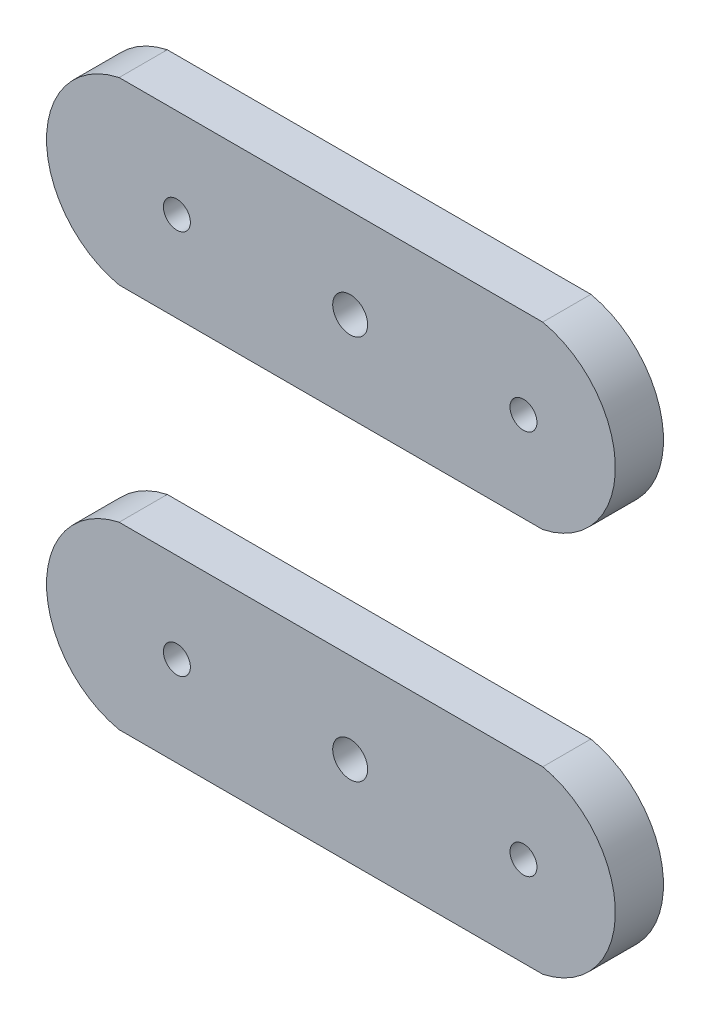
ISO-10303-21;
HEADER;
FILE_DESCRIPTION(('STEP AP214'),'2;1');
FILE_NAME('part.step','',(''),(''),'','','');
FILE_SCHEMA(('AUTOMOTIVE_DESIGN { 1 0 10303 214 1 1 1 1 }'));
ENDSEC;
DATA;
#1=APPLICATION_CONTEXT('core data for automotive mechanical design processes');
#2=APPLICATION_PROTOCOL_DEFINITION('international standard','automotive_design',2000,#1);
#3=PRODUCT_CONTEXT('',#1,'mechanical');
#4=PRODUCT('Part','Part','',(#3));
#5=PRODUCT_RELATED_PRODUCT_CATEGORY('part','',(#4));
#6=PRODUCT_DEFINITION_FORMATION('','',#4);
#7=PRODUCT_DEFINITION_CONTEXT('part definition',#1,'design');
#8=PRODUCT_DEFINITION('design','',#6,#7);
#9=PRODUCT_DEFINITION_SHAPE('','',#8);
#10=(LENGTH_UNIT() NAMED_UNIT(*) SI_UNIT(.MILLI.,.METRE.));
#11=(NAMED_UNIT(*) PLANE_ANGLE_UNIT() SI_UNIT($,.RADIAN.));
#12=(NAMED_UNIT(*) SI_UNIT($,.STERADIAN.) SOLID_ANGLE_UNIT());
#13=UNCERTAINTY_MEASURE_WITH_UNIT(LENGTH_MEASURE(1.E-05),#10,'distance_accuracy_value','');
#14=(GEOMETRIC_REPRESENTATION_CONTEXT(3) GLOBAL_UNCERTAINTY_ASSIGNED_CONTEXT((#13)) GLOBAL_UNIT_ASSIGNED_CONTEXT((#10,
#11,#12)) REPRESENTATION_CONTEXT('',''));
#15=CARTESIAN_POINT('',(0.,0.,0.));
#16=DIRECTION('',(0.,0.,1.));
#17=DIRECTION('',(1.,0.,0.));
#18=AXIS2_PLACEMENT_3D('',#15,#16,#17);
#19=CARTESIAN_POINT('',(16.51,62.6492613140312,6.35));
#20=DIRECTION('',(0.,0.,-1.));
#21=DIRECTION('',(-1.,0.,0.));
#22=AXIS2_PLACEMENT_3D('',#19,#20,#21);
#23=PLANE('',#22);
#24=CARTESIAN_POINT('',(67.31,62.6492613140312,6.35));
#25=DIRECTION('',(0.,0.,1.));
#26=DIRECTION('',(1.,0.,0.));
#27=AXIS2_PLACEMENT_3D('',#24,#25,#26);
#28=CIRCLE('',#27,1.77800000000001);
#29=CARTESIAN_POINT('',(69.088,62.6492613140312,6.35));
#30=VERTEX_POINT('',#29);
#31=EDGE_CURVE('E156',#30,#30,#28,.T.);
#32=ORIENTED_EDGE('',*,*,#31,.F.);
#33=EDGE_LOOP('',(#32));
#34=FACE_BOUND('',#33,.T.);
#35=DIRECTION('',(1.,0.,0.));
#36=VECTOR('',#35,1.);
#37=CARTESIAN_POINT('',(19.05,50.8,6.35));
#38=LINE('',#37,#36);
#39=CARTESIAN_POINT('',(13.97,50.8,6.35));
#40=VERTEX_POINT('',#39);
#41=CARTESIAN_POINT('',(69.85,50.8,6.35));
#42=VERTEX_POINT('',#41);
#43=EDGE_CURVE('E95',#40,#42,#38,.T.);
#44=ORIENTED_EDGE('',*,*,#43,.T.);
#45=CARTESIAN_POINT('',(67.31,62.6492613140312,6.35));
#46=DIRECTION('',(0.,0.,1.));
#47=DIRECTION('',(1.,0.,0.));
#48=AXIS2_PLACEMENT_3D('',#45,#46,#47);
#49=CIRCLE('',#48,12.1184402333054);
#50=CARTESIAN_POINT('',(69.85,74.4985226280624,6.35));
#51=VERTEX_POINT('',#50);
#52=EDGE_CURVE('E98',#42,#51,#49,.T.);
#53=ORIENTED_EDGE('',*,*,#52,.T.);
#54=DIRECTION('',(-1.,0.,0.));
#55=VECTOR('',#54,1.);
#56=CARTESIAN_POINT('',(69.85,74.4985226280624,6.35));
#57=LINE('',#56,#55);
#58=CARTESIAN_POINT('',(13.97,74.4985226280624,6.35));
#59=VERTEX_POINT('',#58);
#60=EDGE_CURVE('E102',#51,#59,#57,.T.);
#61=ORIENTED_EDGE('',*,*,#60,.T.);
#62=CARTESIAN_POINT('',(16.51,62.6492613140312,6.35));
#63=DIRECTION('',(0.,0.,1.));
#64=DIRECTION('',(-1.,0.,0.));
#65=AXIS2_PLACEMENT_3D('',#62,#63,#64);
#66=CIRCLE('',#65,12.1184402333055);
#67=EDGE_CURVE('E67',#59,#40,#66,.T.);
#68=ORIENTED_EDGE('',*,*,#67,.T.);
#69=EDGE_LOOP('',(#44,#53,#61,#68));
#70=FACE_BOUND('',#69,.T.);
#71=CARTESIAN_POINT('',(44.45,62.6492613140312,6.35));
#72=DIRECTION('',(0.,0.,1.));
#73=DIRECTION('',(1.,0.,0.));
#74=AXIS2_PLACEMENT_3D('',#71,#72,#73);
#75=CIRCLE('',#74,2.305);
#76=CARTESIAN_POINT('',(46.755,62.6492613140312,6.35));
#77=VERTEX_POINT('',#76);
#78=EDGE_CURVE('E121',#77,#77,#75,.T.);
#79=ORIENTED_EDGE('',*,*,#78,.F.);
#80=EDGE_LOOP('',(#79));
#81=FACE_BOUND('',#80,.T.);
#82=CARTESIAN_POINT('',(21.59,62.6492613140312,6.35));
#83=DIRECTION('',(0.,0.,1.));
#84=DIRECTION('',(1.,0.,0.));
#85=AXIS2_PLACEMENT_3D('',#82,#83,#84);
#86=CIRCLE('',#85,1.778);
#87=CARTESIAN_POINT('',(23.368,62.6492613140312,6.35));
#88=VERTEX_POINT('',#87);
#89=EDGE_CURVE('E149',#88,#88,#86,.T.);
#90=ORIENTED_EDGE('',*,*,#89,.F.);
#91=EDGE_LOOP('',(#90));
#92=FACE_BOUND('',#91,.T.);
#93=ADVANCED_FACE('F49',(#34,#70,#81,#92),#23,.F.);
#94=CARTESIAN_POINT('',(16.51,62.6492613140312,0.));
#95=DIRECTION('',(0.,0.,-1.));
#96=DIRECTION('',(-1.,0.,0.));
#97=AXIS2_PLACEMENT_3D('',#94,#95,#96);
#98=PLANE('',#97);
#99=CARTESIAN_POINT('',(67.31,62.6492613140312,0.));
#100=DIRECTION('',(0.,0.,1.));
#101=DIRECTION('',(1.,0.,0.));
#102=AXIS2_PLACEMENT_3D('',#99,#100,#101);
#103=CIRCLE('',#102,1.77800000000001);
#104=CARTESIAN_POINT('',(69.088,62.6492613140312,0.));
#105=VERTEX_POINT('',#104);
#106=EDGE_CURVE('E153',#105,#105,#103,.T.);
#107=ORIENTED_EDGE('',*,*,#106,.T.);
#108=EDGE_LOOP('',(#107));
#109=FACE_BOUND('',#108,.T.);
#110=DIRECTION('',(1.,0.,0.));
#111=VECTOR('',#110,1.);
#112=CARTESIAN_POINT('',(19.05,50.8,0.));
#113=LINE('',#112,#111);
#114=CARTESIAN_POINT('',(13.97,50.8,0.));
#115=VERTEX_POINT('',#114);
#116=CARTESIAN_POINT('',(69.85,50.8,0.));
#117=VERTEX_POINT('',#116);
#118=EDGE_CURVE('E90',#115,#117,#113,.T.);
#119=ORIENTED_EDGE('',*,*,#118,.F.);
#120=CARTESIAN_POINT('',(16.51,62.6492613140312,0.));
#121=DIRECTION('',(0.,0.,1.));
#122=DIRECTION('',(-1.,0.,0.));
#123=AXIS2_PLACEMENT_3D('',#120,#121,#122);
#124=CIRCLE('',#123,12.1184402333055);
#125=CARTESIAN_POINT('',(13.97,74.4985226280624,0.));
#126=VERTEX_POINT('',#125);
#127=EDGE_CURVE('E126',#126,#115,#124,.T.);
#128=ORIENTED_EDGE('',*,*,#127,.F.);
#129=DIRECTION('',(-1.,0.,0.));
#130=VECTOR('',#129,1.);
#131=CARTESIAN_POINT('',(19.05,74.4985226280624,0.));
#132=LINE('',#131,#130);
#133=CARTESIAN_POINT('',(69.85,74.4985226280624,0.));
#134=VERTEX_POINT('',#133);
#135=EDGE_CURVE('E83',#134,#126,#132,.T.);
#136=ORIENTED_EDGE('',*,*,#135,.F.);
#137=CARTESIAN_POINT('',(67.31,62.6492613140312,0.));
#138=DIRECTION('',(0.,0.,1.));
#139=DIRECTION('',(1.,0.,0.));
#140=AXIS2_PLACEMENT_3D('',#137,#138,#139);
#141=CIRCLE('',#140,12.1184402333054);
#142=EDGE_CURVE('E108',#117,#134,#141,.T.);
#143=ORIENTED_EDGE('',*,*,#142,.F.);
#144=EDGE_LOOP('',(#119,#128,#136,#143));
#145=FACE_BOUND('',#144,.T.);
#146=CARTESIAN_POINT('',(44.45,62.6492613140312,0.));
#147=DIRECTION('',(0.,0.,1.));
#148=DIRECTION('',(1.,0.,0.));
#149=AXIS2_PLACEMENT_3D('',#146,#147,#148);
#150=CIRCLE('',#149,2.305);
#151=CARTESIAN_POINT('',(46.755,62.6492613140312,0.));
#152=VERTEX_POINT('',#151);
#153=EDGE_CURVE('E143',#152,#152,#150,.T.);
#154=ORIENTED_EDGE('',*,*,#153,.T.);
#155=EDGE_LOOP('',(#154));
#156=FACE_BOUND('',#155,.T.);
#157=CARTESIAN_POINT('',(21.59,62.6492613140312,0.));
#158=DIRECTION('',(0.,0.,1.));
#159=DIRECTION('',(1.,0.,0.));
#160=AXIS2_PLACEMENT_3D('',#157,#158,#159);
#161=CIRCLE('',#160,1.778);
#162=CARTESIAN_POINT('',(23.368,62.6492613140312,0.));
#163=VERTEX_POINT('',#162);
#164=EDGE_CURVE('E146',#163,#163,#161,.T.);
#165=ORIENTED_EDGE('',*,*,#164,.T.);
#166=EDGE_LOOP('',(#165));
#167=FACE_BOUND('',#166,.T.);
#168=ADVANCED_FACE('F135',(#109,#145,#156,#167),#98,.T.);
#169=CARTESIAN_POINT('',(19.05,50.8,6.35));
#170=DIRECTION('',(0.,1.,0.));
#171=DIRECTION('',(-1.,0.,0.));
#172=AXIS2_PLACEMENT_3D('',#169,#170,#171);
#173=PLANE('',#172);
#174=ORIENTED_EDGE('',*,*,#118,.T.);
#175=DIRECTION('',(0.,0.,-1.));
#176=VECTOR('',#175,1.);
#177=CARTESIAN_POINT('',(69.85,50.8,6.35));
#178=LINE('',#177,#176);
#179=EDGE_CURVE('E12',#42,#117,#178,.T.);
#180=ORIENTED_EDGE('',*,*,#179,.F.);
#181=ORIENTED_EDGE('',*,*,#43,.F.);
#182=DIRECTION('',(0.,0.,-1.));
#183=VECTOR('',#182,1.);
#184=CARTESIAN_POINT('',(13.97,50.8,6.35));
#185=LINE('',#184,#183);
#186=EDGE_CURVE('E115',#40,#115,#185,.T.);
#187=ORIENTED_EDGE('',*,*,#186,.T.);
#188=EDGE_LOOP('',(#174,#180,#181,#187));
#189=FACE_BOUND('',#188,.T.);
#190=ADVANCED_FACE('F51',(#189),#173,.F.);
#191=CARTESIAN_POINT('',(67.31,62.6492613140312,6.35));
#192=DIRECTION('',(0.,0.,-1.));
#193=DIRECTION('',(-1.,0.,0.));
#194=AXIS2_PLACEMENT_3D('',#191,#192,#193);
#195=CYLINDRICAL_SURFACE('',#194,12.1184402333054);
#196=ORIENTED_EDGE('',*,*,#142,.T.);
#197=DIRECTION('',(0.,0.,-1.));
#198=VECTOR('',#197,1.);
#199=CARTESIAN_POINT('',(69.85,74.4985226280624,6.35));
#200=LINE('',#199,#198);
#201=EDGE_CURVE('E59',#51,#134,#200,.T.);
#202=ORIENTED_EDGE('',*,*,#201,.F.);
#203=ORIENTED_EDGE('',*,*,#52,.F.);
#204=ORIENTED_EDGE('',*,*,#179,.T.);
#205=EDGE_LOOP('',(#196,#202,#203,#204));
#206=FACE_BOUND('',#205,.T.);
#207=ADVANCED_FACE('F107',(#206),#195,.T.);
#208=CARTESIAN_POINT('',(19.05,74.4985226280624,6.35));
#209=DIRECTION('',(0.,-1.,0.));
#210=DIRECTION('',(1.,0.,0.));
#211=AXIS2_PLACEMENT_3D('',#208,#209,#210);
#212=PLANE('',#211);
#213=ORIENTED_EDGE('',*,*,#135,.T.);
#214=DIRECTION('',(0.,0.,-1.));
#215=VECTOR('',#214,1.);
#216=CARTESIAN_POINT('',(13.97,74.4985226280624,6.35));
#217=LINE('',#216,#215);
#218=EDGE_CURVE('E110',#59,#126,#217,.T.);
#219=ORIENTED_EDGE('',*,*,#218,.F.);
#220=ORIENTED_EDGE('',*,*,#60,.F.);
#221=ORIENTED_EDGE('',*,*,#201,.T.);
#222=EDGE_LOOP('',(#213,#219,#220,#221));
#223=FACE_BOUND('',#222,.T.);
#224=ADVANCED_FACE('F111',(#223),#212,.F.);
#225=CARTESIAN_POINT('',(16.51,62.6492613140312,6.35));
#226=DIRECTION('',(0.,0.,-1.));
#227=DIRECTION('',(-1.,0.,0.));
#228=AXIS2_PLACEMENT_3D('',#225,#226,#227);
#229=CYLINDRICAL_SURFACE('',#228,12.1184402333055);
#230=ORIENTED_EDGE('',*,*,#127,.T.);
#231=ORIENTED_EDGE('',*,*,#186,.F.);
#232=ORIENTED_EDGE('',*,*,#67,.F.);
#233=ORIENTED_EDGE('',*,*,#218,.T.);
#234=EDGE_LOOP('',(#230,#231,#232,#233));
#235=FACE_BOUND('',#234,.T.);
#236=ADVANCED_FACE('F134',(#235),#229,.T.);
#237=CARTESIAN_POINT('',(44.45,62.6492613140312,6.35));
#238=DIRECTION('',(0.,0.,-1.));
#239=DIRECTION('',(-1.,0.,0.));
#240=AXIS2_PLACEMENT_3D('',#237,#238,#239);
#241=CYLINDRICAL_SURFACE('',#240,2.305);
#242=ORIENTED_EDGE('',*,*,#78,.T.);
#243=EDGE_LOOP('',(#242));
#244=FACE_BOUND('',#243,.T.);
#245=ORIENTED_EDGE('',*,*,#153,.F.);
#246=EDGE_LOOP('',(#245));
#247=FACE_BOUND('',#246,.T.);
#248=ADVANCED_FACE('F170',(#244,#247),#241,.F.);
#249=CARTESIAN_POINT('',(67.31,62.6492613140312,6.35));
#250=DIRECTION('',(0.,0.,-1.));
#251=DIRECTION('',(-1.,0.,0.));
#252=AXIS2_PLACEMENT_3D('',#249,#250,#251);
#253=CYLINDRICAL_SURFACE('',#252,1.77800000000001);
#254=ORIENTED_EDGE('',*,*,#31,.T.);
#255=EDGE_LOOP('',(#254));
#256=FACE_BOUND('',#255,.T.);
#257=ORIENTED_EDGE('',*,*,#106,.F.);
#258=EDGE_LOOP('',(#257));
#259=FACE_BOUND('',#258,.T.);
#260=ADVANCED_FACE('F180',(#256,#259),#253,.F.);
#261=CARTESIAN_POINT('',(21.59,62.6492613140312,6.35));
#262=DIRECTION('',(0.,0.,-1.));
#263=DIRECTION('',(-1.,0.,0.));
#264=AXIS2_PLACEMENT_3D('',#261,#262,#263);
#265=CYLINDRICAL_SURFACE('',#264,1.778);
#266=ORIENTED_EDGE('',*,*,#89,.T.);
#267=EDGE_LOOP('',(#266));
#268=FACE_BOUND('',#267,.T.);
#269=ORIENTED_EDGE('',*,*,#164,.F.);
#270=EDGE_LOOP('',(#269));
#271=FACE_BOUND('',#270,.T.);
#272=ADVANCED_FACE('F178',(#268,#271),#265,.F.);
#273=CLOSED_SHELL('',(#93,#168,#190,#207,#224,#236,#248,#260,#272));
#274=MANIFOLD_SOLID_BREP('B2',#273);
#275=CARTESIAN_POINT('',(16.51,11.8492613140312,6.35));
#276=DIRECTION('',(0.,0.,-1.));
#277=DIRECTION('',(-1.,0.,0.));
#278=AXIS2_PLACEMENT_3D('',#275,#276,#277);
#279=PLANE('',#278);
#280=CARTESIAN_POINT('',(67.31,11.8492613140312,6.35));
#281=DIRECTION('',(0.,0.,1.));
#282=DIRECTION('',(1.,0.,0.));
#283=AXIS2_PLACEMENT_3D('',#280,#281,#282);
#284=CIRCLE('',#283,1.77800000000001);
#285=CARTESIAN_POINT('',(69.088,11.8492613140312,6.35));
#286=VERTEX_POINT('',#285);
#287=EDGE_CURVE('E354',#286,#286,#284,.T.);
#288=ORIENTED_EDGE('',*,*,#287,.F.);
#289=EDGE_LOOP('',(#288));
#290=FACE_BOUND('',#289,.T.);
#291=DIRECTION('',(1.,0.,0.));
#292=VECTOR('',#291,1.);
#293=CARTESIAN_POINT('',(19.05,0.,6.35));
#294=LINE('',#293,#292);
#295=CARTESIAN_POINT('',(13.97,0.,6.35));
#296=VERTEX_POINT('',#295);
#297=CARTESIAN_POINT('',(69.85,0.,6.35));
#298=VERTEX_POINT('',#297);
#299=EDGE_CURVE('E305',#296,#298,#294,.T.);
#300=ORIENTED_EDGE('',*,*,#299,.T.);
#301=CARTESIAN_POINT('',(67.31,11.8492613140312,6.35));
#302=DIRECTION('',(0.,0.,1.));
#303=DIRECTION('',(1.,0.,0.));
#304=AXIS2_PLACEMENT_3D('',#301,#302,#303);
#305=CIRCLE('',#304,12.1184402333054);
#306=CARTESIAN_POINT('',(69.85,23.6985226280624,6.35));
#307=VERTEX_POINT('',#306);
#308=EDGE_CURVE('E308',#298,#307,#305,.T.);
#309=ORIENTED_EDGE('',*,*,#308,.T.);
#310=DIRECTION('',(-1.,0.,0.));
#311=VECTOR('',#310,1.);
#312=CARTESIAN_POINT('',(69.85,23.6985226280624,6.35));
#313=LINE('',#312,#311);
#314=CARTESIAN_POINT('',(13.97,23.6985226280624,6.35));
#315=VERTEX_POINT('',#314);
#316=EDGE_CURVE('E312',#307,#315,#313,.T.);
#317=ORIENTED_EDGE('',*,*,#316,.T.);
#318=CARTESIAN_POINT('',(16.51,11.8492613140312,6.35));
#319=DIRECTION('',(0.,0.,1.));
#320=DIRECTION('',(-1.,0.,0.));
#321=AXIS2_PLACEMENT_3D('',#318,#319,#320);
#322=CIRCLE('',#321,12.1184402333055);
#323=EDGE_CURVE('E277',#315,#296,#322,.T.);
#324=ORIENTED_EDGE('',*,*,#323,.T.);
#325=EDGE_LOOP('',(#300,#309,#317,#324));
#326=FACE_BOUND('',#325,.T.);
#327=CARTESIAN_POINT('',(44.45,11.8492613140312,6.35));
#328=DIRECTION('',(0.,0.,1.));
#329=DIRECTION('',(1.,0.,0.));
#330=AXIS2_PLACEMENT_3D('',#327,#328,#329);
#331=CIRCLE('',#330,2.305);
#332=CARTESIAN_POINT('',(46.755,11.8492613140312,6.35));
#333=VERTEX_POINT('',#332);
#334=EDGE_CURVE('E326',#333,#333,#331,.T.);
#335=ORIENTED_EDGE('',*,*,#334,.F.);
#336=EDGE_LOOP('',(#335));
#337=FACE_BOUND('',#336,.T.);
#338=CARTESIAN_POINT('',(21.59,11.8492613140312,6.35));
#339=DIRECTION('',(0.,0.,1.));
#340=DIRECTION('',(1.,0.,0.));
#341=AXIS2_PLACEMENT_3D('',#338,#339,#340);
#342=CIRCLE('',#341,1.778);
#343=CARTESIAN_POINT('',(23.368,11.8492613140312,6.35));
#344=VERTEX_POINT('',#343);
#345=EDGE_CURVE('E348',#344,#344,#342,.T.);
#346=ORIENTED_EDGE('',*,*,#345,.F.);
#347=EDGE_LOOP('',(#346));
#348=FACE_BOUND('',#347,.T.);
#349=ADVANCED_FACE('F260',(#290,#326,#337,#348),#279,.F.);
#350=CARTESIAN_POINT('',(16.51,11.8492613140312,0.));
#351=DIRECTION('',(0.,0.,-1.));
#352=DIRECTION('',(-1.,0.,0.));
#353=AXIS2_PLACEMENT_3D('',#350,#351,#352);
#354=PLANE('',#353);
#355=CARTESIAN_POINT('',(67.31,11.8492613140312,0.));
#356=DIRECTION('',(0.,0.,1.));
#357=DIRECTION('',(1.,0.,0.));
#358=AXIS2_PLACEMENT_3D('',#355,#356,#357);
#359=CIRCLE('',#358,1.77800000000001);
#360=CARTESIAN_POINT('',(69.088,11.8492613140312,0.));
#361=VERTEX_POINT('',#360);
#362=EDGE_CURVE('E351',#361,#361,#359,.T.);
#363=ORIENTED_EDGE('',*,*,#362,.T.);
#364=EDGE_LOOP('',(#363));
#365=FACE_BOUND('',#364,.T.);
#366=DIRECTION('',(1.,0.,0.));
#367=VECTOR('',#366,1.);
#368=CARTESIAN_POINT('',(19.05,0.,0.));
#369=LINE('',#368,#367);
#370=CARTESIAN_POINT('',(13.97,0.,0.));
#371=VERTEX_POINT('',#370);
#372=CARTESIAN_POINT('',(69.85,0.,0.));
#373=VERTEX_POINT('',#372);
#374=EDGE_CURVE('E300',#371,#373,#369,.T.);
#375=ORIENTED_EDGE('',*,*,#374,.F.);
#376=CARTESIAN_POINT('',(16.51,11.8492613140312,0.));
#377=DIRECTION('',(0.,0.,1.));
#378=DIRECTION('',(-1.,0.,0.));
#379=AXIS2_PLACEMENT_3D('',#376,#377,#378);
#380=CIRCLE('',#379,12.1184402333055);
#381=CARTESIAN_POINT('',(13.97,23.6985226280624,0.));
#382=VERTEX_POINT('',#381);
#383=EDGE_CURVE('E329',#382,#371,#380,.T.);
#384=ORIENTED_EDGE('',*,*,#383,.F.);
#385=DIRECTION('',(-1.,0.,0.));
#386=VECTOR('',#385,1.);
#387=CARTESIAN_POINT('',(19.05,23.6985226280624,0.));
#388=LINE('',#387,#386);
#389=CARTESIAN_POINT('',(69.85,23.6985226280624,0.));
#390=VERTEX_POINT('',#389);
#391=EDGE_CURVE('E293',#390,#382,#388,.T.);
#392=ORIENTED_EDGE('',*,*,#391,.F.);
#393=CARTESIAN_POINT('',(67.31,11.8492613140312,0.));
#394=DIRECTION('',(0.,0.,1.));
#395=DIRECTION('',(1.,0.,0.));
#396=AXIS2_PLACEMENT_3D('',#393,#394,#395);
#397=CIRCLE('',#396,12.1184402333054);
#398=EDGE_CURVE('E317',#373,#390,#397,.T.);
#399=ORIENTED_EDGE('',*,*,#398,.F.);
#400=EDGE_LOOP('',(#375,#384,#392,#399));
#401=FACE_BOUND('',#400,.T.);
#402=CARTESIAN_POINT('',(44.45,11.8492613140312,0.));
#403=DIRECTION('',(0.,0.,1.));
#404=DIRECTION('',(1.,0.,0.));
#405=AXIS2_PLACEMENT_3D('',#402,#403,#404);
#406=CIRCLE('',#405,2.305);
#407=CARTESIAN_POINT('',(46.755,11.8492613140312,0.));
#408=VERTEX_POINT('',#407);
#409=EDGE_CURVE('E343',#408,#408,#406,.T.);
#410=ORIENTED_EDGE('',*,*,#409,.T.);
#411=EDGE_LOOP('',(#410));
#412=FACE_BOUND('',#411,.T.);
#413=CARTESIAN_POINT('',(21.59,11.8492613140312,0.));
#414=DIRECTION('',(0.,0.,1.));
#415=DIRECTION('',(1.,0.,0.));
#416=AXIS2_PLACEMENT_3D('',#413,#414,#415);
#417=CIRCLE('',#416,1.778);
#418=CARTESIAN_POINT('',(23.368,11.8492613140312,0.));
#419=VERTEX_POINT('',#418);
#420=EDGE_CURVE('E346',#419,#419,#417,.T.);
#421=ORIENTED_EDGE('',*,*,#420,.T.);
#422=EDGE_LOOP('',(#421));
#423=FACE_BOUND('',#422,.T.);
#424=ADVANCED_FACE('F335',(#365,#401,#412,#423),#354,.T.);
#425=CARTESIAN_POINT('',(19.05,0.,6.35));
#426=DIRECTION('',(0.,1.,0.));
#427=DIRECTION('',(-1.,0.,0.));
#428=AXIS2_PLACEMENT_3D('',#425,#426,#427);
#429=PLANE('',#428);
#430=ORIENTED_EDGE('',*,*,#374,.T.);
#431=DIRECTION('',(0.,0.,-1.));
#432=VECTOR('',#431,1.);
#433=CARTESIAN_POINT('',(69.85,0.,6.35));
#434=LINE('',#433,#432);
#435=EDGE_CURVE('E47',#298,#373,#434,.T.);
#436=ORIENTED_EDGE('',*,*,#435,.F.);
#437=ORIENTED_EDGE('',*,*,#299,.F.);
#438=DIRECTION('',(0.,0.,-1.));
#439=VECTOR('',#438,1.);
#440=CARTESIAN_POINT('',(13.97,0.,6.35));
#441=LINE('',#440,#439);
#442=EDGE_CURVE('E321',#296,#371,#441,.T.);
#443=ORIENTED_EDGE('',*,*,#442,.T.);
#444=EDGE_LOOP('',(#430,#436,#437,#443));
#445=FACE_BOUND('',#444,.T.);
#446=ADVANCED_FACE('F262',(#445),#429,.F.);
#447=CARTESIAN_POINT('',(67.31,11.8492613140312,6.35));
#448=DIRECTION('',(0.,0.,-1.));
#449=DIRECTION('',(-1.,0.,0.));
#450=AXIS2_PLACEMENT_3D('',#447,#448,#449);
#451=CYLINDRICAL_SURFACE('',#450,12.1184402333054);
#452=ORIENTED_EDGE('',*,*,#398,.T.);
#453=DIRECTION('',(0.,0.,-1.));
#454=VECTOR('',#453,1.);
#455=CARTESIAN_POINT('',(69.85,23.6985226280624,6.35));
#456=LINE('',#455,#454);
#457=EDGE_CURVE('E269',#307,#390,#456,.T.);
#458=ORIENTED_EDGE('',*,*,#457,.F.);
#459=ORIENTED_EDGE('',*,*,#308,.F.);
#460=ORIENTED_EDGE('',*,*,#435,.T.);
#461=EDGE_LOOP('',(#452,#458,#459,#460));
#462=FACE_BOUND('',#461,.T.);
#463=ADVANCED_FACE('F316',(#462),#451,.T.);
#464=CARTESIAN_POINT('',(19.05,23.6985226280624,6.35));
#465=DIRECTION('',(0.,-1.,0.));
#466=DIRECTION('',(1.,0.,0.));
#467=AXIS2_PLACEMENT_3D('',#464,#465,#466);
#468=PLANE('',#467);
#469=ORIENTED_EDGE('',*,*,#391,.T.);
#470=DIRECTION('',(0.,0.,-1.));
#471=VECTOR('',#470,1.);
#472=CARTESIAN_POINT('',(13.97,23.6985226280624,6.35));
#473=LINE('',#472,#471);
#474=EDGE_CURVE('E318',#315,#382,#473,.T.);
#475=ORIENTED_EDGE('',*,*,#474,.F.);
#476=ORIENTED_EDGE('',*,*,#316,.F.);
#477=ORIENTED_EDGE('',*,*,#457,.T.);
#478=EDGE_LOOP('',(#469,#475,#476,#477));
#479=FACE_BOUND('',#478,.T.);
#480=ADVANCED_FACE('F319',(#479),#468,.F.);
#481=CARTESIAN_POINT('',(16.51,11.8492613140312,6.35));
#482=DIRECTION('',(0.,0.,-1.));
#483=DIRECTION('',(-1.,0.,0.));
#484=AXIS2_PLACEMENT_3D('',#481,#482,#483);
#485=CYLINDRICAL_SURFACE('',#484,12.1184402333055);
#486=ORIENTED_EDGE('',*,*,#383,.T.);
#487=ORIENTED_EDGE('',*,*,#442,.F.);
#488=ORIENTED_EDGE('',*,*,#323,.F.);
#489=ORIENTED_EDGE('',*,*,#474,.T.);
#490=EDGE_LOOP('',(#486,#487,#488,#489));
#491=FACE_BOUND('',#490,.T.);
#492=ADVANCED_FACE('F334',(#491),#485,.T.);
#493=CARTESIAN_POINT('',(44.45,11.8492613140312,6.35));
#494=DIRECTION('',(0.,0.,-1.));
#495=DIRECTION('',(-1.,0.,0.));
#496=AXIS2_PLACEMENT_3D('',#493,#494,#495);
#497=CYLINDRICAL_SURFACE('',#496,2.305);
#498=ORIENTED_EDGE('',*,*,#334,.T.);
#499=EDGE_LOOP('',(#498));
#500=FACE_BOUND('',#499,.T.);
#501=ORIENTED_EDGE('',*,*,#409,.F.);
#502=EDGE_LOOP('',(#501));
#503=FACE_BOUND('',#502,.T.);
#504=ADVANCED_FACE('F363',(#500,#503),#497,.F.);
#505=CARTESIAN_POINT('',(67.31,11.8492613140312,6.35));
#506=DIRECTION('',(0.,0.,-1.));
#507=DIRECTION('',(-1.,0.,0.));
#508=AXIS2_PLACEMENT_3D('',#505,#506,#507);
#509=CYLINDRICAL_SURFACE('',#508,1.77800000000001);
#510=ORIENTED_EDGE('',*,*,#287,.T.);
#511=EDGE_LOOP('',(#510));
#512=FACE_BOUND('',#511,.T.);
#513=ORIENTED_EDGE('',*,*,#362,.F.);
#514=EDGE_LOOP('',(#513));
#515=FACE_BOUND('',#514,.T.);
#516=ADVANCED_FACE('F373',(#512,#515),#509,.F.);
#517=CARTESIAN_POINT('',(21.59,11.8492613140312,6.35));
#518=DIRECTION('',(0.,0.,-1.));
#519=DIRECTION('',(-1.,0.,0.));
#520=AXIS2_PLACEMENT_3D('',#517,#518,#519);
#521=CYLINDRICAL_SURFACE('',#520,1.778);
#522=ORIENTED_EDGE('',*,*,#345,.T.);
#523=EDGE_LOOP('',(#522));
#524=FACE_BOUND('',#523,.T.);
#525=ORIENTED_EDGE('',*,*,#420,.F.);
#526=EDGE_LOOP('',(#525));
#527=FACE_BOUND('',#526,.T.);
#528=ADVANCED_FACE('F371',(#524,#527),#521,.F.);
#529=CLOSED_SHELL('',(#349,#424,#446,#463,#480,#492,#504,#516,#528));
#530=MANIFOLD_SOLID_BREP('B6',#529);
#531=ADVANCED_BREP_SHAPE_REPRESENTATION('',(#18,#274,#530),#14);
#532=SHAPE_DEFINITION_REPRESENTATION(#9,#531);
ENDSEC;
END-ISO-10303-21;
